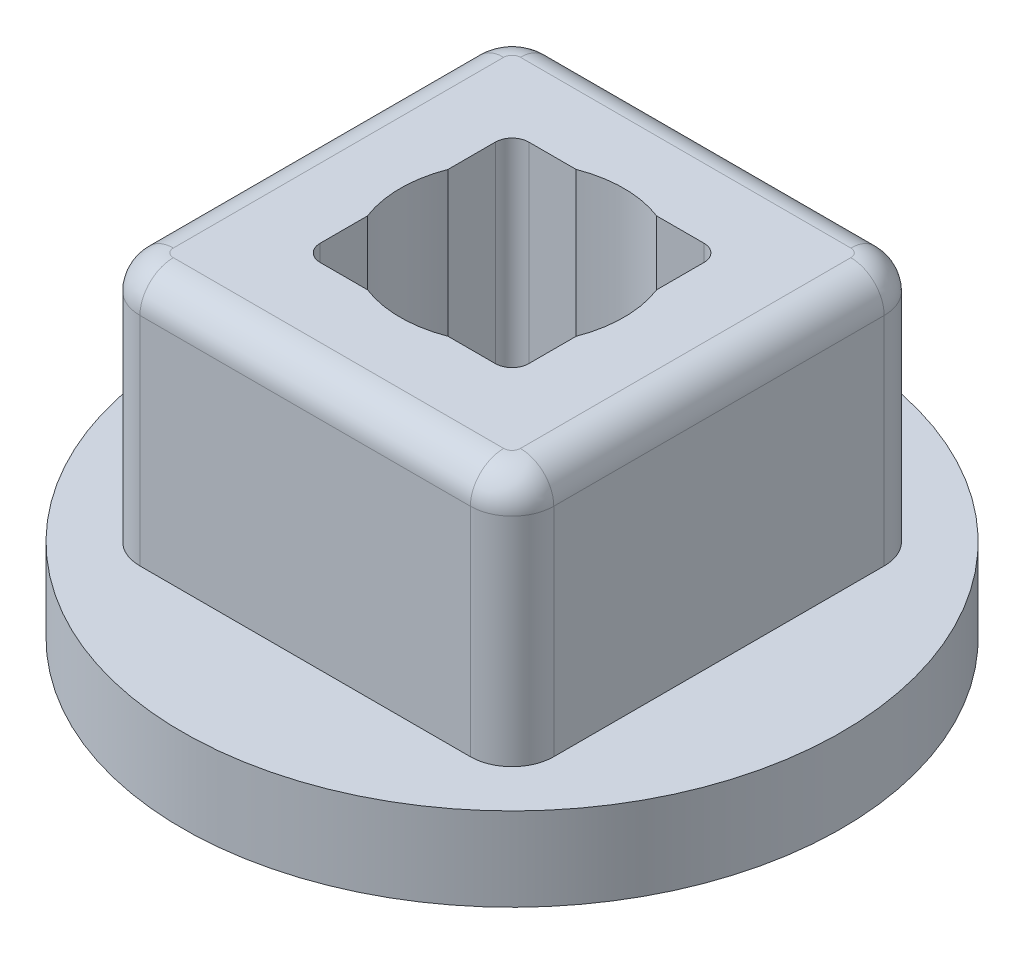
ISO-10303-21;
HEADER;
FILE_DESCRIPTION(('STEP AP214'),'2;1');
FILE_NAME('part.step','',(''),(''),'','','');
FILE_SCHEMA(('AUTOMOTIVE_DESIGN { 1 0 10303 214 1 1 1 1 }'));
ENDSEC;
DATA;
#1=APPLICATION_CONTEXT('core data for automotive mechanical design processes');
#2=APPLICATION_PROTOCOL_DEFINITION('international standard','automotive_design',2000,#1);
#3=PRODUCT_CONTEXT('',#1,'mechanical');
#4=PRODUCT('Part','Part','',(#3));
#5=PRODUCT_RELATED_PRODUCT_CATEGORY('part','',(#4));
#6=PRODUCT_DEFINITION_FORMATION('','',#4);
#7=PRODUCT_DEFINITION_CONTEXT('part definition',#1,'design');
#8=PRODUCT_DEFINITION('design','',#6,#7);
#9=PRODUCT_DEFINITION_SHAPE('','',#8);
#10=(LENGTH_UNIT() NAMED_UNIT(*) SI_UNIT(.MILLI.,.METRE.));
#11=(NAMED_UNIT(*) PLANE_ANGLE_UNIT() SI_UNIT($,.RADIAN.));
#12=(NAMED_UNIT(*) SI_UNIT($,.STERADIAN.) SOLID_ANGLE_UNIT());
#13=UNCERTAINTY_MEASURE_WITH_UNIT(LENGTH_MEASURE(1.E-05),#10,'distance_accuracy_value','');
#14=(GEOMETRIC_REPRESENTATION_CONTEXT(3) GLOBAL_UNCERTAINTY_ASSIGNED_CONTEXT((#13)) GLOBAL_UNIT_ASSIGNED_CONTEXT((#10,
#11,#12)) REPRESENTATION_CONTEXT('',''));
#15=CARTESIAN_POINT('',(0.,0.,0.));
#16=DIRECTION('',(0.,0.,1.));
#17=DIRECTION('',(1.,0.,0.));
#18=AXIS2_PLACEMENT_3D('',#15,#16,#17);
#19=CARTESIAN_POINT('',(-1.5875,5.08,1.5875));
#20=DIRECTION('',(-1.,0.,0.));
#21=DIRECTION('',(0.,0.,1.));
#22=AXIS2_PLACEMENT_3D('',#19,#20,#21);
#23=PLANE('',#22);
#24=DIRECTION('',(0.,0.,-1.));
#25=VECTOR('',#24,1.);
#26=CARTESIAN_POINT('',(-1.5875,0.,1.5875));
#27=LINE('',#26,#25);
#28=CARTESIAN_POINT('',(-1.5875,0.,1.3335));
#29=VERTEX_POINT('',#28);
#30=CARTESIAN_POINT('',(-1.5875,0.,0.613161471392323));
#31=VERTEX_POINT('',#30);
#32=EDGE_CURVE('E253',#29,#31,#27,.T.);
#33=ORIENTED_EDGE('',*,*,#32,.T.);
#34=DIRECTION('',(0.,1.,0.));
#35=VECTOR('',#34,1.);
#36=CARTESIAN_POINT('',(-1.5875,-45.974,0.613161471392323));
#37=LINE('',#36,#35);
#38=CARTESIAN_POINT('',(-1.5875,5.08,0.613161471392323));
#39=VERTEX_POINT('',#38);
#40=EDGE_CURVE('E389',#31,#39,#37,.T.);
#41=ORIENTED_EDGE('',*,*,#40,.T.);
#42=DIRECTION('',(0.,0.,-1.));
#43=VECTOR('',#42,1.);
#44=CARTESIAN_POINT('',(-1.5875,5.08,1.5875));
#45=LINE('',#44,#43);
#46=CARTESIAN_POINT('',(-1.5875,5.08,1.3335));
#47=VERTEX_POINT('',#46);
#48=EDGE_CURVE('E440',#47,#39,#45,.T.);
#49=ORIENTED_EDGE('',*,*,#48,.F.);
#50=DIRECTION('',(0.,-1.,0.));
#51=VECTOR('',#50,1.);
#52=CARTESIAN_POINT('',(-1.5875,0.,1.3335));
#53=LINE('',#52,#51);
#54=EDGE_CURVE('E313',#47,#29,#53,.T.);
#55=ORIENTED_EDGE('',*,*,#54,.T.);
#56=EDGE_LOOP('',(#33,#41,#49,#55));
#57=FACE_BOUND('',#56,.T.);
#58=ADVANCED_FACE('F34',(#57),#23,.F.);
#59=CARTESIAN_POINT('',(1.5875,5.08,1.5875));
#60=DIRECTION('',(0.,0.,1.));
#61=DIRECTION('',(1.,0.,0.));
#62=AXIS2_PLACEMENT_3D('',#59,#60,#61);
#63=PLANE('',#62);
#64=DIRECTION('',(-1.,0.,0.));
#65=VECTOR('',#64,1.);
#66=CARTESIAN_POINT('',(1.5875,0.,1.5875));
#67=LINE('',#66,#65);
#68=CARTESIAN_POINT('',(1.3335,0.,1.5875));
#69=VERTEX_POINT('',#68);
#70=CARTESIAN_POINT('',(0.613161471392323,0.,1.5875));
#71=VERTEX_POINT('',#70);
#72=EDGE_CURVE('E236',#69,#71,#67,.T.);
#73=ORIENTED_EDGE('',*,*,#72,.T.);
#74=DIRECTION('',(0.,1.,0.));
#75=VECTOR('',#74,1.);
#76=CARTESIAN_POINT('',(0.613161471392323,-45.974,1.5875));
#77=LINE('',#76,#75);
#78=CARTESIAN_POINT('',(0.613161471392323,5.08,1.5875));
#79=VERTEX_POINT('',#78);
#80=EDGE_CURVE('E220',#71,#79,#77,.T.);
#81=ORIENTED_EDGE('',*,*,#80,.T.);
#82=DIRECTION('',(-1.,0.,0.));
#83=VECTOR('',#82,1.);
#84=CARTESIAN_POINT('',(1.5875,5.08,1.5875));
#85=LINE('',#84,#83);
#86=CARTESIAN_POINT('',(1.3335,5.08,1.5875));
#87=VERTEX_POINT('',#86);
#88=EDGE_CURVE('E233',#87,#79,#85,.T.);
#89=ORIENTED_EDGE('',*,*,#88,.F.);
#90=DIRECTION('',(0.,-1.,0.));
#91=VECTOR('',#90,1.);
#92=CARTESIAN_POINT('',(1.3335,0.,1.5875));
#93=LINE('',#92,#91);
#94=EDGE_CURVE('E316',#87,#69,#93,.T.);
#95=ORIENTED_EDGE('',*,*,#94,.T.);
#96=EDGE_LOOP('',(#73,#81,#89,#95));
#97=FACE_BOUND('',#96,.T.);
#98=ADVANCED_FACE('F231',(#97),#63,.F.);
#99=CARTESIAN_POINT('',(1.5875,5.08,-1.5875));
#100=DIRECTION('',(1.,0.,0.));
#101=DIRECTION('',(0.,0.,-1.));
#102=AXIS2_PLACEMENT_3D('',#99,#100,#101);
#103=PLANE('',#102);
#104=DIRECTION('',(0.,0.,1.));
#105=VECTOR('',#104,1.);
#106=CARTESIAN_POINT('',(1.5875,0.,-1.5875));
#107=LINE('',#106,#105);
#108=CARTESIAN_POINT('',(1.5875,0.,-1.3335));
#109=VERTEX_POINT('',#108);
#110=CARTESIAN_POINT('',(1.5875,0.,-0.613161471392323));
#111=VERTEX_POINT('',#110);
#112=EDGE_CURVE('E262',#109,#111,#107,.T.);
#113=ORIENTED_EDGE('',*,*,#112,.T.);
#114=DIRECTION('',(0.,1.,0.));
#115=VECTOR('',#114,1.);
#116=CARTESIAN_POINT('',(1.5875,-45.974,-0.613161471392323));
#117=LINE('',#116,#115);
#118=CARTESIAN_POINT('',(1.5875,5.08,-0.613161471392323));
#119=VERTEX_POINT('',#118);
#120=EDGE_CURVE('E434',#111,#119,#117,.T.);
#121=ORIENTED_EDGE('',*,*,#120,.T.);
#122=DIRECTION('',(0.,0.,1.));
#123=VECTOR('',#122,1.);
#124=CARTESIAN_POINT('',(1.5875,5.08,-1.5875));
#125=LINE('',#124,#123);
#126=CARTESIAN_POINT('',(1.5875,5.08,-1.3335));
#127=VERTEX_POINT('',#126);
#128=EDGE_CURVE('E249',#127,#119,#125,.T.);
#129=ORIENTED_EDGE('',*,*,#128,.F.);
#130=DIRECTION('',(0.,-1.,0.));
#131=VECTOR('',#130,1.);
#132=CARTESIAN_POINT('',(1.5875,0.,-1.3335));
#133=LINE('',#132,#131);
#134=EDGE_CURVE('E330',#127,#109,#133,.T.);
#135=ORIENTED_EDGE('',*,*,#134,.T.);
#136=EDGE_LOOP('',(#113,#121,#129,#135));
#137=FACE_BOUND('',#136,.T.);
#138=ADVANCED_FACE('F433',(#137),#103,.F.);
#139=CARTESIAN_POINT('',(-1.5875,5.08,-1.5875));
#140=DIRECTION('',(0.,0.,-1.));
#141=DIRECTION('',(-1.,0.,0.));
#142=AXIS2_PLACEMENT_3D('',#139,#140,#141);
#143=PLANE('',#142);
#144=DIRECTION('',(1.,0.,0.));
#145=VECTOR('',#144,1.);
#146=CARTESIAN_POINT('',(-1.5875,0.,-1.5875));
#147=LINE('',#146,#145);
#148=CARTESIAN_POINT('',(-1.3335,0.,-1.5875));
#149=VERTEX_POINT('',#148);
#150=CARTESIAN_POINT('',(-0.613161471392323,0.,-1.5875));
#151=VERTEX_POINT('',#150);
#152=EDGE_CURVE('E258',#149,#151,#147,.T.);
#153=ORIENTED_EDGE('',*,*,#152,.T.);
#154=DIRECTION('',(0.,1.,0.));
#155=VECTOR('',#154,1.);
#156=CARTESIAN_POINT('',(-0.613161471392323,-45.974,-1.5875));
#157=LINE('',#156,#155);
#158=CARTESIAN_POINT('',(-0.613161471392323,5.08,-1.5875));
#159=VERTEX_POINT('',#158);
#160=EDGE_CURVE('E11',#151,#159,#157,.T.);
#161=ORIENTED_EDGE('',*,*,#160,.T.);
#162=DIRECTION('',(1.,0.,0.));
#163=VECTOR('',#162,1.);
#164=CARTESIAN_POINT('',(-1.5875,5.08,-1.5875));
#165=LINE('',#164,#163);
#166=CARTESIAN_POINT('',(-1.3335,5.08,-1.5875));
#167=VERTEX_POINT('',#166);
#168=EDGE_CURVE('E436',#167,#159,#165,.T.);
#169=ORIENTED_EDGE('',*,*,#168,.F.);
#170=DIRECTION('',(0.,-1.,0.));
#171=VECTOR('',#170,1.);
#172=CARTESIAN_POINT('',(-1.3335,0.,-1.5875));
#173=LINE('',#172,#171);
#174=EDGE_CURVE('E324',#167,#149,#173,.T.);
#175=ORIENTED_EDGE('',*,*,#174,.T.);
#176=EDGE_LOOP('',(#153,#161,#169,#175));
#177=FACE_BOUND('',#176,.T.);
#178=ADVANCED_FACE('F501',(#177),#143,.F.);
#179=CARTESIAN_POINT('',(5.0165,1.27,0.));
#180=DIRECTION('',(0.,1.,0.));
#181=DIRECTION('',(0.,0.,1.));
#182=AXIS2_PLACEMENT_3D('',#179,#180,#181);
#183=PLANE('',#182);
#184=CARTESIAN_POINT('',(0.,1.27,0.));
#185=DIRECTION('',(0.,-1.,0.));
#186=DIRECTION('',(0.,0.,-1.));
#187=AXIS2_PLACEMENT_3D('',#184,#185,#186);
#188=CIRCLE('',#187,5.0165);
#189=CARTESIAN_POINT('',(0.,1.27,-5.0165));
#190=VERTEX_POINT('',#189);
#191=EDGE_CURVE('E279',#190,#190,#188,.T.);
#192=ORIENTED_EDGE('',*,*,#191,.F.);
#193=EDGE_LOOP('',(#192));
#194=FACE_BOUND('',#193,.T.);
#195=DIRECTION('',(-1.,0.,0.));
#196=VECTOR('',#195,1.);
#197=CARTESIAN_POINT('',(-3.1496,1.27,-3.1496));
#198=LINE('',#197,#196);
#199=CARTESIAN_POINT('',(2.5146,1.27,-3.1496));
#200=VERTEX_POINT('',#199);
#201=CARTESIAN_POINT('',(-2.5146,1.27,-3.1496));
#202=VERTEX_POINT('',#201);
#203=EDGE_CURVE('E247',#200,#202,#198,.T.);
#204=ORIENTED_EDGE('',*,*,#203,.F.);
#205=CARTESIAN_POINT('',(2.5146,1.27,-2.5146));
#206=DIRECTION('',(0.,1.,0.));
#207=DIRECTION('',(0.,0.,1.));
#208=AXIS2_PLACEMENT_3D('',#205,#206,#207);
#209=CIRCLE('',#208,0.635);
#210=CARTESIAN_POINT('',(3.1496,1.27,-2.5146));
#211=VERTEX_POINT('',#210);
#212=EDGE_CURVE('E308',#200,#211,#209,.F.);
#213=ORIENTED_EDGE('',*,*,#212,.T.);
#214=DIRECTION('',(0.,0.,-1.));
#215=VECTOR('',#214,1.);
#216=CARTESIAN_POINT('',(3.1496,1.27,-3.1496));
#217=LINE('',#216,#215);
#218=CARTESIAN_POINT('',(3.1496,1.27,2.5146));
#219=VERTEX_POINT('',#218);
#220=EDGE_CURVE('E243',#219,#211,#217,.T.);
#221=ORIENTED_EDGE('',*,*,#220,.F.);
#222=CARTESIAN_POINT('',(2.5146,1.27,2.5146));
#223=DIRECTION('',(0.,1.,0.));
#224=DIRECTION('',(0.,0.,1.));
#225=AXIS2_PLACEMENT_3D('',#222,#223,#224);
#226=CIRCLE('',#225,0.635);
#227=CARTESIAN_POINT('',(2.5146,1.27,3.1496));
#228=VERTEX_POINT('',#227);
#229=EDGE_CURVE('E304',#219,#228,#226,.F.);
#230=ORIENTED_EDGE('',*,*,#229,.T.);
#231=DIRECTION('',(1.,0.,0.));
#232=VECTOR('',#231,1.);
#233=CARTESIAN_POINT('',(3.1496,1.27,3.1496));
#234=LINE('',#233,#232);
#235=CARTESIAN_POINT('',(-2.5146,1.27,3.1496));
#236=VERTEX_POINT('',#235);
#237=EDGE_CURVE('E273',#236,#228,#234,.T.);
#238=ORIENTED_EDGE('',*,*,#237,.F.);
#239=CARTESIAN_POINT('',(-2.5146,1.27,2.5146));
#240=DIRECTION('',(0.,1.,0.));
#241=DIRECTION('',(0.,0.,1.));
#242=AXIS2_PLACEMENT_3D('',#239,#240,#241);
#243=CIRCLE('',#242,0.635);
#244=CARTESIAN_POINT('',(-3.1496,1.27,2.5146));
#245=VERTEX_POINT('',#244);
#246=EDGE_CURVE('E302',#236,#245,#243,.F.);
#247=ORIENTED_EDGE('',*,*,#246,.T.);
#248=DIRECTION('',(0.,0.,1.));
#249=VECTOR('',#248,1.);
#250=CARTESIAN_POINT('',(-3.1496,1.27,3.1496));
#251=LINE('',#250,#249);
#252=CARTESIAN_POINT('',(-3.1496,1.27,-2.5146));
#253=VERTEX_POINT('',#252);
#254=EDGE_CURVE('E270',#253,#245,#251,.T.);
#255=ORIENTED_EDGE('',*,*,#254,.F.);
#256=CARTESIAN_POINT('',(-2.5146,1.27,-2.5146));
#257=DIRECTION('',(0.,1.,0.));
#258=DIRECTION('',(0.,0.,1.));
#259=AXIS2_PLACEMENT_3D('',#256,#257,#258);
#260=CIRCLE('',#259,0.635);
#261=EDGE_CURVE('E306',#253,#202,#260,.F.);
#262=ORIENTED_EDGE('',*,*,#261,.T.);
#263=EDGE_LOOP('',(#204,#213,#221,#230,#238,#247,#255,#262));
#264=FACE_BOUND('',#263,.T.);
#265=ADVANCED_FACE('F532',(#194,#264),#183,.T.);
#266=CARTESIAN_POINT('',(0.,1.27,0.));
#267=DIRECTION('',(0.,-1.,0.));
#268=DIRECTION('',(0.,0.,-1.));
#269=AXIS2_PLACEMENT_3D('',#266,#267,#268);
#270=CYLINDRICAL_SURFACE('',#269,5.0165);
#271=ORIENTED_EDGE('',*,*,#191,.T.);
#272=EDGE_LOOP('',(#271));
#273=FACE_BOUND('',#272,.T.);
#274=CARTESIAN_POINT('',(0.,0.,0.));
#275=DIRECTION('',(0.,-1.,0.));
#276=DIRECTION('',(0.,0.,-1.));
#277=AXIS2_PLACEMENT_3D('',#274,#275,#276);
#278=CIRCLE('',#277,5.0165);
#279=CARTESIAN_POINT('',(0.,0.,-5.0165));
#280=VERTEX_POINT('',#279);
#281=EDGE_CURVE('E276',#280,#280,#278,.T.);
#282=ORIENTED_EDGE('',*,*,#281,.F.);
#283=EDGE_LOOP('',(#282));
#284=FACE_BOUND('',#283,.T.);
#285=ADVANCED_FACE('F529',(#273,#284),#270,.T.);
#286=CARTESIAN_POINT('',(0.,0.,0.));
#287=DIRECTION('',(0.,-1.,0.));
#288=DIRECTION('',(0.,0.,-1.));
#289=AXIS2_PLACEMENT_3D('',#286,#287,#288);
#290=PLANE('',#289);
#291=CARTESIAN_POINT('',(0.,0.,0.));
#292=DIRECTION('',(0.,-1.,0.));
#293=DIRECTION('',(0.,0.,-1.));
#294=AXIS2_PLACEMENT_3D('',#291,#292,#293);
#295=CIRCLE('',#294,1.7018);
#296=CARTESIAN_POINT('',(1.5875,0.,0.613161471392323));
#297=VERTEX_POINT('',#296);
#298=EDGE_CURVE('E449',#111,#297,#295,.T.);
#299=ORIENTED_EDGE('',*,*,#298,.F.);
#300=ORIENTED_EDGE('',*,*,#112,.F.);
#301=CARTESIAN_POINT('',(1.3335,0.,-1.3335));
#302=DIRECTION('',(0.,-1.,0.));
#303=DIRECTION('',(0.,0.,-1.));
#304=AXIS2_PLACEMENT_3D('',#301,#302,#303);
#305=CIRCLE('',#304,0.254);
#306=CARTESIAN_POINT('',(1.3335,0.,-1.5875));
#307=VERTEX_POINT('',#306);
#308=EDGE_CURVE('E343',#109,#307,#305,.F.);
#309=ORIENTED_EDGE('',*,*,#308,.T.);
#310=CARTESIAN_POINT('',(0.613161471392323,0.,-1.5875));
#311=VERTEX_POINT('',#310);
#312=EDGE_CURVE('E256',#311,#307,#147,.T.);
#313=ORIENTED_EDGE('',*,*,#312,.F.);
#314=EDGE_CURVE('E422',#151,#311,#295,.T.);
#315=ORIENTED_EDGE('',*,*,#314,.F.);
#316=ORIENTED_EDGE('',*,*,#152,.F.);
#317=CARTESIAN_POINT('',(-1.3335,0.,-1.3335));
#318=DIRECTION('',(0.,-1.,0.));
#319=DIRECTION('',(0.,0.,-1.));
#320=AXIS2_PLACEMENT_3D('',#317,#318,#319);
#321=CIRCLE('',#320,0.254);
#322=CARTESIAN_POINT('',(-1.5875,0.,-1.3335));
#323=VERTEX_POINT('',#322);
#324=EDGE_CURVE('E338',#149,#323,#321,.F.);
#325=ORIENTED_EDGE('',*,*,#324,.T.);
#326=CARTESIAN_POINT('',(-1.5875,0.,-0.613161471392323));
#327=VERTEX_POINT('',#326);
#328=EDGE_CURVE('E257',#327,#323,#27,.T.);
#329=ORIENTED_EDGE('',*,*,#328,.F.);
#330=EDGE_CURVE('E49',#31,#327,#295,.T.);
#331=ORIENTED_EDGE('',*,*,#330,.F.);
#332=ORIENTED_EDGE('',*,*,#32,.F.);
#333=CARTESIAN_POINT('',(-1.3335,0.,1.3335));
#334=DIRECTION('',(0.,-1.,0.));
#335=DIRECTION('',(0.,0.,-1.));
#336=AXIS2_PLACEMENT_3D('',#333,#334,#335);
#337=CIRCLE('',#336,0.254);
#338=CARTESIAN_POINT('',(-1.3335,0.,1.5875));
#339=VERTEX_POINT('',#338);
#340=EDGE_CURVE('E333',#29,#339,#337,.F.);
#341=ORIENTED_EDGE('',*,*,#340,.T.);
#342=CARTESIAN_POINT('',(-0.613161471392323,0.,1.5875));
#343=VERTEX_POINT('',#342);
#344=EDGE_CURVE('E265',#343,#339,#67,.T.);
#345=ORIENTED_EDGE('',*,*,#344,.F.);
#346=EDGE_CURVE('E57',#71,#343,#295,.T.);
#347=ORIENTED_EDGE('',*,*,#346,.F.);
#348=ORIENTED_EDGE('',*,*,#72,.F.);
#349=CARTESIAN_POINT('',(1.3335,0.,1.3335));
#350=DIRECTION('',(0.,-1.,0.));
#351=DIRECTION('',(0.,0.,-1.));
#352=AXIS2_PLACEMENT_3D('',#349,#350,#351);
#353=CIRCLE('',#352,0.254);
#354=CARTESIAN_POINT('',(1.5875,0.,1.3335));
#355=VERTEX_POINT('',#354);
#356=EDGE_CURVE('E348',#69,#355,#353,.F.);
#357=ORIENTED_EDGE('',*,*,#356,.T.);
#358=EDGE_CURVE('E261',#297,#355,#107,.T.);
#359=ORIENTED_EDGE('',*,*,#358,.F.);
#360=EDGE_LOOP('',(#299,#300,#309,#313,#315,#316,#325,#329,#331,#332,#341,#345,#347,#348,#357,#359));
#361=FACE_BOUND('',#360,.T.);
#362=ORIENTED_EDGE('',*,*,#281,.T.);
#363=EDGE_LOOP('',(#362));
#364=FACE_BOUND('',#363,.T.);
#365=ADVANCED_FACE('F419',(#361,#364),#290,.T.);
#366=CARTESIAN_POINT('',(3.1496,5.08,-3.1496));
#367=DIRECTION('',(-1.,0.,0.));
#368=DIRECTION('',(0.,0.,1.));
#369=AXIS2_PLACEMENT_3D('',#366,#367,#368);
#370=PLANE('',#369);
#371=DIRECTION('',(0.,-1.,0.));
#372=VECTOR('',#371,1.);
#373=CARTESIAN_POINT('',(3.1496,5.08,-2.5146));
#374=LINE('',#373,#372);
#375=CARTESIAN_POINT('',(3.1496,4.572,-2.5146));
#376=VERTEX_POINT('',#375);
#377=EDGE_CURVE('E292',#211,#376,#374,.F.);
#378=ORIENTED_EDGE('',*,*,#377,.T.);
#379=DIRECTION('',(0.,0.,-1.));
#380=VECTOR('',#379,1.);
#381=CARTESIAN_POINT('',(3.1496,4.572,-3.1496));
#382=LINE('',#381,#380);
#383=CARTESIAN_POINT('',(3.1496,4.572,2.5146));
#384=VERTEX_POINT('',#383);
#385=EDGE_CURVE('E384',#376,#384,#382,.F.);
#386=ORIENTED_EDGE('',*,*,#385,.T.);
#387=DIRECTION('',(0.,-1.,0.));
#388=VECTOR('',#387,1.);
#389=CARTESIAN_POINT('',(3.1496,5.08,2.5146));
#390=LINE('',#389,#388);
#391=EDGE_CURVE('E295',#384,#219,#390,.T.);
#392=ORIENTED_EDGE('',*,*,#391,.T.);
#393=ORIENTED_EDGE('',*,*,#220,.T.);
#394=EDGE_LOOP('',(#378,#386,#392,#393));
#395=FACE_BOUND('',#394,.T.);
#396=ADVANCED_FACE('F539',(#395),#370,.F.);
#397=CARTESIAN_POINT('',(-3.1496,5.08,-3.1496));
#398=DIRECTION('',(0.,0.,1.));
#399=DIRECTION('',(1.,0.,0.));
#400=AXIS2_PLACEMENT_3D('',#397,#398,#399);
#401=PLANE('',#400);
#402=DIRECTION('',(0.,-1.,0.));
#403=VECTOR('',#402,1.);
#404=CARTESIAN_POINT('',(-2.5146,5.08,-3.1496));
#405=LINE('',#404,#403);
#406=CARTESIAN_POINT('',(-2.5146,4.572,-3.1496));
#407=VERTEX_POINT('',#406);
#408=EDGE_CURVE('E299',#202,#407,#405,.F.);
#409=ORIENTED_EDGE('',*,*,#408,.T.);
#410=DIRECTION('',(-1.,0.,0.));
#411=VECTOR('',#410,1.);
#412=CARTESIAN_POINT('',(-3.1496,4.572,-3.1496));
#413=LINE('',#412,#411);
#414=CARTESIAN_POINT('',(2.5146,4.572,-3.1496));
#415=VERTEX_POINT('',#414);
#416=EDGE_CURVE('E378',#407,#415,#413,.F.);
#417=ORIENTED_EDGE('',*,*,#416,.T.);
#418=DIRECTION('',(0.,-1.,0.));
#419=VECTOR('',#418,1.);
#420=CARTESIAN_POINT('',(2.5146,5.08,-3.1496));
#421=LINE('',#420,#419);
#422=EDGE_CURVE('E297',#415,#200,#421,.T.);
#423=ORIENTED_EDGE('',*,*,#422,.T.);
#424=ORIENTED_EDGE('',*,*,#203,.T.);
#425=EDGE_LOOP('',(#409,#417,#423,#424));
#426=FACE_BOUND('',#425,.T.);
#427=ADVANCED_FACE('F542',(#426),#401,.F.);
#428=CARTESIAN_POINT('',(-3.1496,5.08,3.1496));
#429=DIRECTION('',(1.,0.,0.));
#430=DIRECTION('',(0.,0.,-1.));
#431=AXIS2_PLACEMENT_3D('',#428,#429,#430);
#432=PLANE('',#431);
#433=DIRECTION('',(0.,-1.,0.));
#434=VECTOR('',#433,1.);
#435=CARTESIAN_POINT('',(-3.1496,5.08,2.5146));
#436=LINE('',#435,#434);
#437=CARTESIAN_POINT('',(-3.1496,4.572,2.5146));
#438=VERTEX_POINT('',#437);
#439=EDGE_CURVE('E289',#245,#438,#436,.F.);
#440=ORIENTED_EDGE('',*,*,#439,.T.);
#441=DIRECTION('',(0.,0.,1.));
#442=VECTOR('',#441,1.);
#443=CARTESIAN_POINT('',(-3.1496,4.572,3.1496));
#444=LINE('',#443,#442);
#445=CARTESIAN_POINT('',(-3.1496,4.572,-2.5146));
#446=VERTEX_POINT('',#445);
#447=EDGE_CURVE('E369',#438,#446,#444,.F.);
#448=ORIENTED_EDGE('',*,*,#447,.T.);
#449=DIRECTION('',(0.,-1.,0.));
#450=VECTOR('',#449,1.);
#451=CARTESIAN_POINT('',(-3.1496,5.08,-2.5146));
#452=LINE('',#451,#450);
#453=EDGE_CURVE('E287',#446,#253,#452,.T.);
#454=ORIENTED_EDGE('',*,*,#453,.T.);
#455=ORIENTED_EDGE('',*,*,#254,.T.);
#456=EDGE_LOOP('',(#440,#448,#454,#455));
#457=FACE_BOUND('',#456,.T.);
#458=ADVANCED_FACE('F546',(#457),#432,.F.);
#459=CARTESIAN_POINT('',(3.1496,5.08,3.1496));
#460=DIRECTION('',(0.,0.,-1.));
#461=DIRECTION('',(-1.,0.,0.));
#462=AXIS2_PLACEMENT_3D('',#459,#460,#461);
#463=PLANE('',#462);
#464=DIRECTION('',(0.,-1.,0.));
#465=VECTOR('',#464,1.);
#466=CARTESIAN_POINT('',(2.5146,5.08,3.1496));
#467=LINE('',#466,#465);
#468=CARTESIAN_POINT('',(2.5146,4.572,3.1496));
#469=VERTEX_POINT('',#468);
#470=EDGE_CURVE('E282',#228,#469,#467,.F.);
#471=ORIENTED_EDGE('',*,*,#470,.T.);
#472=DIRECTION('',(1.,0.,0.));
#473=VECTOR('',#472,1.);
#474=CARTESIAN_POINT('',(3.1496,4.572,3.1496));
#475=LINE('',#474,#473);
#476=CARTESIAN_POINT('',(-2.5146,4.572,3.1496));
#477=VERTEX_POINT('',#476);
#478=EDGE_CURVE('E376',#469,#477,#475,.F.);
#479=ORIENTED_EDGE('',*,*,#478,.T.);
#480=DIRECTION('',(0.,-1.,0.));
#481=VECTOR('',#480,1.);
#482=CARTESIAN_POINT('',(-2.5146,5.08,3.1496));
#483=LINE('',#482,#481);
#484=EDGE_CURVE('E285',#477,#236,#483,.T.);
#485=ORIENTED_EDGE('',*,*,#484,.T.);
#486=ORIENTED_EDGE('',*,*,#237,.T.);
#487=EDGE_LOOP('',(#471,#479,#485,#486));
#488=FACE_BOUND('',#487,.T.);
#489=ADVANCED_FACE('F491',(#488),#463,.F.);
#490=CARTESIAN_POINT('',(0.,5.08,0.));
#491=DIRECTION('',(0.,-1.,0.));
#492=DIRECTION('',(0.,0.,-1.));
#493=AXIS2_PLACEMENT_3D('',#490,#491,#492);
#494=PLANE('',#493);
#495=CARTESIAN_POINT('',(-2.5146,5.08,-2.5146));
#496=DIRECTION('',(0.,-1.,0.));
#497=DIRECTION('',(0.,0.,-1.));
#498=AXIS2_PLACEMENT_3D('',#495,#496,#497);
#499=CIRCLE('',#498,0.127);
#500=CARTESIAN_POINT('',(-2.5146,5.08,-2.6416));
#501=VERTEX_POINT('',#500);
#502=CARTESIAN_POINT('',(-2.6416,5.08,-2.5146));
#503=VERTEX_POINT('',#502);
#504=EDGE_CURVE('E362',#501,#503,#499,.F.);
#505=ORIENTED_EDGE('',*,*,#504,.T.);
#506=DIRECTION('',(0.,0.,1.));
#507=VECTOR('',#506,1.);
#508=CARTESIAN_POINT('',(-2.6416,5.08,0.));
#509=LINE('',#508,#507);
#510=CARTESIAN_POINT('',(-2.6416,5.08,2.5146));
#511=VERTEX_POINT('',#510);
#512=EDGE_CURVE('E366',#503,#511,#509,.T.);
#513=ORIENTED_EDGE('',*,*,#512,.T.);
#514=CARTESIAN_POINT('',(-2.5146,5.08,2.5146));
#515=DIRECTION('',(0.,-1.,0.));
#516=DIRECTION('',(0.,0.,-1.));
#517=AXIS2_PLACEMENT_3D('',#514,#515,#516);
#518=CIRCLE('',#517,0.127);
#519=CARTESIAN_POINT('',(-2.5146,5.08,2.6416));
#520=VERTEX_POINT('',#519);
#521=EDGE_CURVE('E364',#511,#520,#518,.F.);
#522=ORIENTED_EDGE('',*,*,#521,.T.);
#523=DIRECTION('',(1.,0.,0.));
#524=VECTOR('',#523,1.);
#525=CARTESIAN_POINT('',(0.,5.08,2.6416));
#526=LINE('',#525,#524);
#527=CARTESIAN_POINT('',(2.5146,5.08,2.6416));
#528=VERTEX_POINT('',#527);
#529=EDGE_CURVE('E360',#520,#528,#526,.T.);
#530=ORIENTED_EDGE('',*,*,#529,.T.);
#531=CARTESIAN_POINT('',(2.5146,5.08,2.5146));
#532=DIRECTION('',(0.,-1.,0.));
#533=DIRECTION('',(0.,0.,-1.));
#534=AXIS2_PLACEMENT_3D('',#531,#532,#533);
#535=CIRCLE('',#534,0.127);
#536=CARTESIAN_POINT('',(2.6416,5.08,2.5146));
#537=VERTEX_POINT('',#536);
#538=EDGE_CURVE('E356',#528,#537,#535,.F.);
#539=ORIENTED_EDGE('',*,*,#538,.T.);
#540=DIRECTION('',(0.,0.,-1.));
#541=VECTOR('',#540,1.);
#542=CARTESIAN_POINT('',(2.6416,5.08,0.));
#543=LINE('',#542,#541);
#544=CARTESIAN_POINT('',(2.6416,5.08,-2.5146));
#545=VERTEX_POINT('',#544);
#546=EDGE_CURVE('E352',#537,#545,#543,.T.);
#547=ORIENTED_EDGE('',*,*,#546,.T.);
#548=CARTESIAN_POINT('',(2.5146,5.08,-2.5146));
#549=DIRECTION('',(0.,-1.,0.));
#550=DIRECTION('',(0.,0.,-1.));
#551=AXIS2_PLACEMENT_3D('',#548,#549,#550);
#552=CIRCLE('',#551,0.127);
#553=CARTESIAN_POINT('',(2.5146,5.08,-2.6416));
#554=VERTEX_POINT('',#553);
#555=EDGE_CURVE('E354',#545,#554,#552,.F.);
#556=ORIENTED_EDGE('',*,*,#555,.T.);
#557=DIRECTION('',(-1.,0.,0.));
#558=VECTOR('',#557,1.);
#559=CARTESIAN_POINT('',(0.,5.08,-2.6416));
#560=LINE('',#559,#558);
#561=EDGE_CURVE('E358',#554,#501,#560,.T.);
#562=ORIENTED_EDGE('',*,*,#561,.T.);
#563=EDGE_LOOP('',(#505,#513,#522,#530,#539,#547,#556,#562));
#564=FACE_BOUND('',#563,.T.);
#565=ORIENTED_EDGE('',*,*,#128,.T.);
#566=CARTESIAN_POINT('',(0.,5.08,0.));
#567=DIRECTION('',(0.,1.,0.));
#568=DIRECTION('',(0.,0.,1.));
#569=AXIS2_PLACEMENT_3D('',#566,#567,#568);
#570=CIRCLE('',#569,1.7018);
#571=CARTESIAN_POINT('',(1.5875,5.08,0.613161471392323));
#572=VERTEX_POINT('',#571);
#573=EDGE_CURVE('E227',#572,#119,#570,.T.);
#574=ORIENTED_EDGE('',*,*,#573,.F.);
#575=CARTESIAN_POINT('',(1.5875,5.08,1.3335));
#576=VERTEX_POINT('',#575);
#577=EDGE_CURVE('E435',#572,#576,#125,.T.);
#578=ORIENTED_EDGE('',*,*,#577,.T.);
#579=CARTESIAN_POINT('',(1.3335,5.08,1.3335));
#580=DIRECTION('',(0.,-1.,0.));
#581=DIRECTION('',(0.,0.,-1.));
#582=AXIS2_PLACEMENT_3D('',#579,#580,#581);
#583=CIRCLE('',#582,0.254);
#584=EDGE_CURVE('E242',#576,#87,#583,.T.);
#585=ORIENTED_EDGE('',*,*,#584,.T.);
#586=ORIENTED_EDGE('',*,*,#88,.T.);
#587=CARTESIAN_POINT('',(-0.613161471392323,5.08,1.5875));
#588=VERTEX_POINT('',#587);
#589=EDGE_CURVE('E217',#588,#79,#570,.T.);
#590=ORIENTED_EDGE('',*,*,#589,.F.);
#591=CARTESIAN_POINT('',(-1.3335,5.08,1.5875));
#592=VERTEX_POINT('',#591);
#593=EDGE_CURVE('E244',#588,#592,#85,.T.);
#594=ORIENTED_EDGE('',*,*,#593,.T.);
#595=CARTESIAN_POINT('',(-1.3335,5.08,1.3335));
#596=DIRECTION('',(0.,-1.,0.));
#597=DIRECTION('',(0.,0.,-1.));
#598=AXIS2_PLACEMENT_3D('',#595,#596,#597);
#599=CIRCLE('',#598,0.254);
#600=EDGE_CURVE('E336',#592,#47,#599,.T.);
#601=ORIENTED_EDGE('',*,*,#600,.T.);
#602=ORIENTED_EDGE('',*,*,#48,.T.);
#603=CARTESIAN_POINT('',(-1.5875,5.08,-0.613161471392323));
#604=VERTEX_POINT('',#603);
#605=EDGE_CURVE('E225',#604,#39,#570,.T.);
#606=ORIENTED_EDGE('',*,*,#605,.F.);
#607=CARTESIAN_POINT('',(-1.5875,5.08,-1.3335));
#608=VERTEX_POINT('',#607);
#609=EDGE_CURVE('E266',#604,#608,#45,.T.);
#610=ORIENTED_EDGE('',*,*,#609,.T.);
#611=CARTESIAN_POINT('',(-1.3335,5.08,-1.3335));
#612=DIRECTION('',(0.,-1.,0.));
#613=DIRECTION('',(0.,0.,-1.));
#614=AXIS2_PLACEMENT_3D('',#611,#612,#613);
#615=CIRCLE('',#614,0.254);
#616=EDGE_CURVE('E341',#608,#167,#615,.T.);
#617=ORIENTED_EDGE('',*,*,#616,.T.);
#618=ORIENTED_EDGE('',*,*,#168,.T.);
#619=CARTESIAN_POINT('',(0.613161471392323,5.08,-1.5875));
#620=VERTEX_POINT('',#619);
#621=EDGE_CURVE('E453',#620,#159,#570,.T.);
#622=ORIENTED_EDGE('',*,*,#621,.F.);
#623=CARTESIAN_POINT('',(1.3335,5.08,-1.5875));
#624=VERTEX_POINT('',#623);
#625=EDGE_CURVE('E413',#620,#624,#165,.T.);
#626=ORIENTED_EDGE('',*,*,#625,.T.);
#627=CARTESIAN_POINT('',(1.3335,5.08,-1.3335));
#628=DIRECTION('',(0.,-1.,0.));
#629=DIRECTION('',(0.,0.,-1.));
#630=AXIS2_PLACEMENT_3D('',#627,#628,#629);
#631=CIRCLE('',#630,0.254);
#632=EDGE_CURVE('E346',#624,#127,#631,.T.);
#633=ORIENTED_EDGE('',*,*,#632,.T.);
#634=EDGE_LOOP('',(#565,#574,#578,#585,#586,#590,#594,#601,#602,#606,#610,#617,#618,#622,#626,#633));
#635=FACE_BOUND('',#634,.T.);
#636=ADVANCED_FACE('F240',(#564,#635),#494,.F.);
#637=ORIENTED_EDGE('',*,*,#609,.F.);
#638=DIRECTION('',(0.,1.,0.));
#639=VECTOR('',#638,1.);
#640=CARTESIAN_POINT('',(-1.5875,-45.974,-0.613161471392323));
#641=LINE('',#640,#639);
#642=EDGE_CURVE('E237',#604,#327,#641,.F.);
#643=ORIENTED_EDGE('',*,*,#642,.T.);
#644=ORIENTED_EDGE('',*,*,#328,.T.);
#645=DIRECTION('',(0.,-1.,0.));
#646=VECTOR('',#645,1.);
#647=CARTESIAN_POINT('',(-1.5875,5.08,-1.3335));
#648=LINE('',#647,#646);
#649=EDGE_CURVE('E310',#323,#608,#648,.F.);
#650=ORIENTED_EDGE('',*,*,#649,.T.);
#651=EDGE_LOOP('',(#637,#643,#644,#650));
#652=FACE_BOUND('',#651,.T.);
#653=ADVANCED_FACE('F476',(#652),#23,.F.);
#654=ORIENTED_EDGE('',*,*,#593,.F.);
#655=DIRECTION('',(0.,1.,0.));
#656=VECTOR('',#655,1.);
#657=CARTESIAN_POINT('',(-0.613161471392323,-45.974,1.5875));
#658=LINE('',#657,#656);
#659=EDGE_CURVE('E221',#588,#343,#658,.F.);
#660=ORIENTED_EDGE('',*,*,#659,.T.);
#661=ORIENTED_EDGE('',*,*,#344,.T.);
#662=DIRECTION('',(0.,-1.,0.));
#663=VECTOR('',#662,1.);
#664=CARTESIAN_POINT('',(-1.3335,5.08,1.5875));
#665=LINE('',#664,#663);
#666=EDGE_CURVE('E318',#339,#592,#665,.F.);
#667=ORIENTED_EDGE('',*,*,#666,.T.);
#668=EDGE_LOOP('',(#654,#660,#661,#667));
#669=FACE_BOUND('',#668,.T.);
#670=ADVANCED_FACE('F481',(#669),#63,.F.);
#671=ORIENTED_EDGE('',*,*,#577,.F.);
#672=DIRECTION('',(0.,1.,0.));
#673=VECTOR('',#672,1.);
#674=CARTESIAN_POINT('',(1.5875,-45.974,0.613161471392323));
#675=LINE('',#674,#673);
#676=EDGE_CURVE('E450',#572,#297,#675,.F.);
#677=ORIENTED_EDGE('',*,*,#676,.T.);
#678=ORIENTED_EDGE('',*,*,#358,.T.);
#679=DIRECTION('',(0.,-1.,0.));
#680=VECTOR('',#679,1.);
#681=CARTESIAN_POINT('',(1.5875,5.08,1.3335));
#682=LINE('',#681,#680);
#683=EDGE_CURVE('E327',#355,#576,#682,.F.);
#684=ORIENTED_EDGE('',*,*,#683,.T.);
#685=EDGE_LOOP('',(#671,#677,#678,#684));
#686=FACE_BOUND('',#685,.T.);
#687=ADVANCED_FACE('F458',(#686),#103,.F.);
#688=ORIENTED_EDGE('',*,*,#625,.F.);
#689=DIRECTION('',(0.,1.,0.));
#690=VECTOR('',#689,1.);
#691=CARTESIAN_POINT('',(0.613161471392323,-45.974,-1.5875));
#692=LINE('',#691,#690);
#693=EDGE_CURVE('E42',#620,#311,#692,.F.);
#694=ORIENTED_EDGE('',*,*,#693,.T.);
#695=ORIENTED_EDGE('',*,*,#312,.T.);
#696=DIRECTION('',(0.,-1.,0.));
#697=VECTOR('',#696,1.);
#698=CARTESIAN_POINT('',(1.3335,5.08,-1.5875));
#699=LINE('',#698,#697);
#700=EDGE_CURVE('E321',#307,#624,#699,.F.);
#701=ORIENTED_EDGE('',*,*,#700,.T.);
#702=EDGE_LOOP('',(#688,#694,#695,#701));
#703=FACE_BOUND('',#702,.T.);
#704=ADVANCED_FACE('F412',(#703),#143,.F.);
#705=CARTESIAN_POINT('',(-2.5146,5.08,2.5146));
#706=DIRECTION('',(0.,-1.,0.));
#707=DIRECTION('',(0.,0.,-1.));
#708=AXIS2_PLACEMENT_3D('',#705,#706,#707);
#709=CYLINDRICAL_SURFACE('',#708,0.635);
#710=ORIENTED_EDGE('',*,*,#484,.F.);
#711=CARTESIAN_POINT('',(-2.5146,4.572,2.5146));
#712=DIRECTION('',(0.,-1.,0.));
#713=DIRECTION('',(0.,0.,-1.));
#714=AXIS2_PLACEMENT_3D('',#711,#712,#713);
#715=CIRCLE('',#714,0.635);
#716=EDGE_CURVE('E372',#477,#438,#715,.T.);
#717=ORIENTED_EDGE('',*,*,#716,.T.);
#718=ORIENTED_EDGE('',*,*,#439,.F.);
#719=ORIENTED_EDGE('',*,*,#246,.F.);
#720=EDGE_LOOP('',(#710,#717,#718,#719));
#721=FACE_BOUND('',#720,.T.);
#722=ADVANCED_FACE('F524',(#721),#709,.T.);
#723=CARTESIAN_POINT('',(2.5146,5.08,2.5146));
#724=DIRECTION('',(0.,-1.,0.));
#725=DIRECTION('',(0.,0.,-1.));
#726=AXIS2_PLACEMENT_3D('',#723,#724,#725);
#727=CYLINDRICAL_SURFACE('',#726,0.635);
#728=ORIENTED_EDGE('',*,*,#391,.F.);
#729=CARTESIAN_POINT('',(2.5146,4.572,2.5146));
#730=DIRECTION('',(0.,-1.,0.));
#731=DIRECTION('',(0.,0.,-1.));
#732=AXIS2_PLACEMENT_3D('',#729,#730,#731);
#733=CIRCLE('',#732,0.635);
#734=EDGE_CURVE('E380',#384,#469,#733,.T.);
#735=ORIENTED_EDGE('',*,*,#734,.T.);
#736=ORIENTED_EDGE('',*,*,#470,.F.);
#737=ORIENTED_EDGE('',*,*,#229,.F.);
#738=EDGE_LOOP('',(#728,#735,#736,#737));
#739=FACE_BOUND('',#738,.T.);
#740=ADVANCED_FACE('F520',(#739),#727,.T.);
#741=CARTESIAN_POINT('',(-2.5146,5.08,-2.5146));
#742=DIRECTION('',(0.,-1.,0.));
#743=DIRECTION('',(0.,0.,-1.));
#744=AXIS2_PLACEMENT_3D('',#741,#742,#743);
#745=CYLINDRICAL_SURFACE('',#744,0.635);
#746=ORIENTED_EDGE('',*,*,#453,.F.);
#747=CARTESIAN_POINT('',(-2.5146,4.572,-2.5146));
#748=DIRECTION('',(0.,-1.,0.));
#749=DIRECTION('',(0.,0.,-1.));
#750=AXIS2_PLACEMENT_3D('',#747,#748,#749);
#751=CIRCLE('',#750,0.635);
#752=EDGE_CURVE('E374',#446,#407,#751,.T.);
#753=ORIENTED_EDGE('',*,*,#752,.T.);
#754=ORIENTED_EDGE('',*,*,#408,.F.);
#755=ORIENTED_EDGE('',*,*,#261,.F.);
#756=EDGE_LOOP('',(#746,#753,#754,#755));
#757=FACE_BOUND('',#756,.T.);
#758=ADVANCED_FACE('F516',(#757),#745,.T.);
#759=CARTESIAN_POINT('',(2.5146,5.08,-2.5146));
#760=DIRECTION('',(0.,-1.,0.));
#761=DIRECTION('',(0.,0.,-1.));
#762=AXIS2_PLACEMENT_3D('',#759,#760,#761);
#763=CYLINDRICAL_SURFACE('',#762,0.635);
#764=ORIENTED_EDGE('',*,*,#422,.F.);
#765=CARTESIAN_POINT('',(2.5146,4.572,-2.5146));
#766=DIRECTION('',(0.,-1.,0.));
#767=DIRECTION('',(0.,0.,-1.));
#768=AXIS2_PLACEMENT_3D('',#765,#766,#767);
#769=CIRCLE('',#768,0.635);
#770=EDGE_CURVE('E382',#415,#376,#769,.T.);
#771=ORIENTED_EDGE('',*,*,#770,.T.);
#772=ORIENTED_EDGE('',*,*,#377,.F.);
#773=ORIENTED_EDGE('',*,*,#212,.F.);
#774=EDGE_LOOP('',(#764,#771,#772,#773));
#775=FACE_BOUND('',#774,.T.);
#776=ADVANCED_FACE('F510',(#775),#763,.T.);
#777=CARTESIAN_POINT('',(-1.3335,5.08,1.3335));
#778=DIRECTION('',(0.,1.,0.));
#779=DIRECTION('',(0.,0.,1.));
#780=AXIS2_PLACEMENT_3D('',#777,#778,#779);
#781=CYLINDRICAL_SURFACE('',#780,0.254);
#782=ORIENTED_EDGE('',*,*,#600,.F.);
#783=ORIENTED_EDGE('',*,*,#666,.F.);
#784=ORIENTED_EDGE('',*,*,#340,.F.);
#785=ORIENTED_EDGE('',*,*,#54,.F.);
#786=EDGE_LOOP('',(#782,#783,#784,#785));
#787=FACE_BOUND('',#786,.T.);
#788=ADVANCED_FACE('F505',(#787),#781,.F.);
#789=CARTESIAN_POINT('',(-1.3335,5.08,-1.3335));
#790=DIRECTION('',(0.,1.,0.));
#791=DIRECTION('',(0.,0.,1.));
#792=AXIS2_PLACEMENT_3D('',#789,#790,#791);
#793=CYLINDRICAL_SURFACE('',#792,0.254);
#794=ORIENTED_EDGE('',*,*,#616,.F.);
#795=ORIENTED_EDGE('',*,*,#649,.F.);
#796=ORIENTED_EDGE('',*,*,#324,.F.);
#797=ORIENTED_EDGE('',*,*,#174,.F.);
#798=EDGE_LOOP('',(#794,#795,#796,#797));
#799=FACE_BOUND('',#798,.T.);
#800=ADVANCED_FACE('F470',(#799),#793,.F.);
#801=CARTESIAN_POINT('',(1.3335,5.08,-1.3335));
#802=DIRECTION('',(0.,1.,0.));
#803=DIRECTION('',(0.,0.,1.));
#804=AXIS2_PLACEMENT_3D('',#801,#802,#803);
#805=CYLINDRICAL_SURFACE('',#804,0.254);
#806=ORIENTED_EDGE('',*,*,#632,.F.);
#807=ORIENTED_EDGE('',*,*,#700,.F.);
#808=ORIENTED_EDGE('',*,*,#308,.F.);
#809=ORIENTED_EDGE('',*,*,#134,.F.);
#810=EDGE_LOOP('',(#806,#807,#808,#809));
#811=FACE_BOUND('',#810,.T.);
#812=ADVANCED_FACE('F428',(#811),#805,.F.);
#813=CARTESIAN_POINT('',(1.3335,5.08,1.3335));
#814=DIRECTION('',(0.,1.,0.));
#815=DIRECTION('',(0.,0.,1.));
#816=AXIS2_PLACEMENT_3D('',#813,#814,#815);
#817=CYLINDRICAL_SURFACE('',#816,0.254);
#818=ORIENTED_EDGE('',*,*,#584,.F.);
#819=ORIENTED_EDGE('',*,*,#683,.F.);
#820=ORIENTED_EDGE('',*,*,#356,.F.);
#821=ORIENTED_EDGE('',*,*,#94,.F.);
#822=EDGE_LOOP('',(#818,#819,#820,#821));
#823=FACE_BOUND('',#822,.T.);
#824=ADVANCED_FACE('F461',(#823),#817,.F.);
#825=CARTESIAN_POINT('',(2.6416,4.572,0.));
#826=DIRECTION('',(0.,0.,-1.));
#827=DIRECTION('',(-1.,0.,0.));
#828=AXIS2_PLACEMENT_3D('',#825,#826,#827);
#829=CYLINDRICAL_SURFACE('',#828,0.508);
#830=CARTESIAN_POINT('',(2.6416,4.572,2.5146));
#831=DIRECTION('',(0.,0.,1.));
#832=DIRECTION('',(1.,0.,0.));
#833=AXIS2_PLACEMENT_3D('',#830,#831,#832);
#834=CIRCLE('',#833,0.508);
#835=EDGE_CURVE('E403',#384,#537,#834,.T.);
#836=ORIENTED_EDGE('',*,*,#835,.F.);
#837=ORIENTED_EDGE('',*,*,#385,.F.);
#838=CARTESIAN_POINT('',(2.6416,4.572,-2.5146));
#839=DIRECTION('',(0.,0.,-1.));
#840=DIRECTION('',(-1.,0.,0.));
#841=AXIS2_PLACEMENT_3D('',#838,#839,#840);
#842=CIRCLE('',#841,0.508);
#843=EDGE_CURVE('E406',#545,#376,#842,.T.);
#844=ORIENTED_EDGE('',*,*,#843,.F.);
#845=ORIENTED_EDGE('',*,*,#546,.F.);
#846=EDGE_LOOP('',(#836,#837,#844,#845));
#847=FACE_BOUND('',#846,.T.);
#848=ADVANCED_FACE('F36',(#847),#829,.T.);
#849=CARTESIAN_POINT('',(2.5146,4.572,-2.5146));
#850=DIRECTION('',(0.,-1.,0.));
#851=DIRECTION('',(0.,0.,-1.));
#852=AXIS2_PLACEMENT_3D('',#849,#850,#851);
#853=DEGENERATE_TOROIDAL_SURFACE('',#852,0.127,0.508,.T.);
#854=ORIENTED_EDGE('',*,*,#843,.T.);
#855=ORIENTED_EDGE('',*,*,#770,.F.);
#856=CARTESIAN_POINT('',(2.5146,4.572,-2.6416));
#857=DIRECTION('',(-1.,0.,0.));
#858=DIRECTION('',(0.,0.,1.));
#859=AXIS2_PLACEMENT_3D('',#856,#857,#858);
#860=CIRCLE('',#859,0.508);
#861=EDGE_CURVE('E400',#554,#415,#860,.T.);
#862=ORIENTED_EDGE('',*,*,#861,.F.);
#863=ORIENTED_EDGE('',*,*,#555,.F.);
#864=EDGE_LOOP('',(#854,#855,#862,#863));
#865=FACE_BOUND('',#864,.T.);
#866=ADVANCED_FACE('F468',(#865),#853,.T.);
#867=CARTESIAN_POINT('',(2.5146,4.572,2.5146));
#868=DIRECTION('',(0.,-1.,0.));
#869=DIRECTION('',(0.,0.,-1.));
#870=AXIS2_PLACEMENT_3D('',#867,#868,#869);
#871=DEGENERATE_TOROIDAL_SURFACE('',#870,0.127,0.508,.T.);
#872=ORIENTED_EDGE('',*,*,#835,.T.);
#873=ORIENTED_EDGE('',*,*,#538,.F.);
#874=CARTESIAN_POINT('',(2.5146,4.572,2.6416));
#875=DIRECTION('',(-1.,0.,0.));
#876=DIRECTION('',(0.,0.,1.));
#877=AXIS2_PLACEMENT_3D('',#874,#875,#876);
#878=CIRCLE('',#877,0.508);
#879=EDGE_CURVE('E397',#469,#528,#878,.T.);
#880=ORIENTED_EDGE('',*,*,#879,.F.);
#881=ORIENTED_EDGE('',*,*,#734,.F.);
#882=EDGE_LOOP('',(#872,#873,#880,#881));
#883=FACE_BOUND('',#882,.T.);
#884=ADVANCED_FACE('F564',(#883),#871,.T.);
#885=CARTESIAN_POINT('',(0.,4.572,-2.6416));
#886=DIRECTION('',(-1.,0.,0.));
#887=DIRECTION('',(0.,0.,1.));
#888=AXIS2_PLACEMENT_3D('',#885,#886,#887);
#889=CYLINDRICAL_SURFACE('',#888,0.508);
#890=ORIENTED_EDGE('',*,*,#861,.T.);
#891=ORIENTED_EDGE('',*,*,#416,.F.);
#892=CARTESIAN_POINT('',(-2.5146,4.572,-2.6416));
#893=DIRECTION('',(-1.,0.,0.));
#894=DIRECTION('',(0.,0.,1.));
#895=AXIS2_PLACEMENT_3D('',#892,#893,#894);
#896=CIRCLE('',#895,0.508);
#897=EDGE_CURVE('E394',#501,#407,#896,.T.);
#898=ORIENTED_EDGE('',*,*,#897,.F.);
#899=ORIENTED_EDGE('',*,*,#561,.F.);
#900=EDGE_LOOP('',(#890,#891,#898,#899));
#901=FACE_BOUND('',#900,.T.);
#902=ADVANCED_FACE('F594',(#901),#889,.T.);
#903=CARTESIAN_POINT('',(0.,4.572,2.6416));
#904=DIRECTION('',(1.,0.,0.));
#905=DIRECTION('',(0.,0.,-1.));
#906=AXIS2_PLACEMENT_3D('',#903,#904,#905);
#907=CYLINDRICAL_SURFACE('',#906,0.508);
#908=ORIENTED_EDGE('',*,*,#879,.T.);
#909=ORIENTED_EDGE('',*,*,#529,.F.);
#910=CARTESIAN_POINT('',(-2.5146,4.572,2.6416));
#911=DIRECTION('',(-1.,0.,0.));
#912=DIRECTION('',(0.,0.,1.));
#913=AXIS2_PLACEMENT_3D('',#910,#911,#912);
#914=CIRCLE('',#913,0.508);
#915=EDGE_CURVE('E391',#477,#520,#914,.T.);
#916=ORIENTED_EDGE('',*,*,#915,.F.);
#917=ORIENTED_EDGE('',*,*,#478,.F.);
#918=EDGE_LOOP('',(#908,#909,#916,#917));
#919=FACE_BOUND('',#918,.T.);
#920=ADVANCED_FACE('F568',(#919),#907,.T.);
#921=CARTESIAN_POINT('',(-2.5146,4.572,-2.5146));
#922=DIRECTION('',(0.,-1.,0.));
#923=DIRECTION('',(0.,0.,-1.));
#924=AXIS2_PLACEMENT_3D('',#921,#922,#923);
#925=DEGENERATE_TOROIDAL_SURFACE('',#924,0.127,0.508,.T.);
#926=ORIENTED_EDGE('',*,*,#897,.T.);
#927=ORIENTED_EDGE('',*,*,#752,.F.);
#928=CARTESIAN_POINT('',(-2.6416,4.572,-2.5146));
#929=DIRECTION('',(0.,0.,1.));
#930=DIRECTION('',(1.,0.,0.));
#931=AXIS2_PLACEMENT_3D('',#928,#929,#930);
#932=CIRCLE('',#931,0.508);
#933=EDGE_CURVE('E388',#503,#446,#932,.T.);
#934=ORIENTED_EDGE('',*,*,#933,.F.);
#935=ORIENTED_EDGE('',*,*,#504,.F.);
#936=EDGE_LOOP('',(#926,#927,#934,#935));
#937=FACE_BOUND('',#936,.T.);
#938=ADVANCED_FACE('F586',(#937),#925,.T.);
#939=CARTESIAN_POINT('',(-2.5146,4.572,2.5146));
#940=DIRECTION('',(0.,-1.,0.));
#941=DIRECTION('',(0.,0.,-1.));
#942=AXIS2_PLACEMENT_3D('',#939,#940,#941);
#943=DEGENERATE_TOROIDAL_SURFACE('',#942,0.127,0.508,.T.);
#944=ORIENTED_EDGE('',*,*,#915,.T.);
#945=ORIENTED_EDGE('',*,*,#521,.F.);
#946=CARTESIAN_POINT('',(-2.6416,4.572,2.5146));
#947=DIRECTION('',(0.,0.,-1.));
#948=DIRECTION('',(-1.,0.,0.));
#949=AXIS2_PLACEMENT_3D('',#946,#947,#948);
#950=CIRCLE('',#949,0.508);
#951=EDGE_CURVE('E386',#438,#511,#950,.T.);
#952=ORIENTED_EDGE('',*,*,#951,.F.);
#953=ORIENTED_EDGE('',*,*,#716,.F.);
#954=EDGE_LOOP('',(#944,#945,#952,#953));
#955=FACE_BOUND('',#954,.T.);
#956=ADVANCED_FACE('F573',(#955),#943,.T.);
#957=CARTESIAN_POINT('',(-2.6416,4.572,0.));
#958=DIRECTION('',(0.,0.,1.));
#959=DIRECTION('',(1.,0.,0.));
#960=AXIS2_PLACEMENT_3D('',#957,#958,#959);
#961=CYLINDRICAL_SURFACE('',#960,0.508);
#962=ORIENTED_EDGE('',*,*,#933,.T.);
#963=ORIENTED_EDGE('',*,*,#447,.F.);
#964=ORIENTED_EDGE('',*,*,#951,.T.);
#965=ORIENTED_EDGE('',*,*,#512,.F.);
#966=EDGE_LOOP('',(#962,#963,#964,#965));
#967=FACE_BOUND('',#966,.T.);
#968=ADVANCED_FACE('F580',(#967),#961,.T.);
#969=CARTESIAN_POINT('',(0.,-45.974,0.));
#970=DIRECTION('',(0.,1.,0.));
#971=DIRECTION('',(0.,0.,1.));
#972=AXIS2_PLACEMENT_3D('',#969,#970,#971);
#973=CYLINDRICAL_SURFACE('',#972,1.7018);
#974=ORIENTED_EDGE('',*,*,#314,.T.);
#975=ORIENTED_EDGE('',*,*,#693,.F.);
#976=ORIENTED_EDGE('',*,*,#621,.T.);
#977=ORIENTED_EDGE('',*,*,#160,.F.);
#978=EDGE_LOOP('',(#974,#975,#976,#977));
#979=FACE_BOUND('',#978,.T.);
#980=ADVANCED_FACE('F499',(#979),#973,.F.);
#981=ORIENTED_EDGE('',*,*,#298,.T.);
#982=ORIENTED_EDGE('',*,*,#676,.F.);
#983=ORIENTED_EDGE('',*,*,#573,.T.);
#984=ORIENTED_EDGE('',*,*,#120,.F.);
#985=EDGE_LOOP('',(#981,#982,#983,#984));
#986=FACE_BOUND('',#985,.T.);
#987=ADVANCED_FACE('F455',(#986),#973,.F.);
#988=ORIENTED_EDGE('',*,*,#346,.T.);
#989=ORIENTED_EDGE('',*,*,#659,.F.);
#990=ORIENTED_EDGE('',*,*,#589,.T.);
#991=ORIENTED_EDGE('',*,*,#80,.F.);
#992=EDGE_LOOP('',(#988,#989,#990,#991));
#993=FACE_BOUND('',#992,.T.);
#994=ADVANCED_FACE('F219',(#993),#973,.F.);
#995=ORIENTED_EDGE('',*,*,#330,.T.);
#996=ORIENTED_EDGE('',*,*,#642,.F.);
#997=ORIENTED_EDGE('',*,*,#605,.T.);
#998=ORIENTED_EDGE('',*,*,#40,.F.);
#999=EDGE_LOOP('',(#995,#996,#997,#998));
#1000=FACE_BOUND('',#999,.T.);
#1001=ADVANCED_FACE('F627',(#1000),#973,.F.);
#1002=CLOSED_SHELL('',(#58,#98,#138,#178,#265,#285,#365,#396,#427,#458,#489,#636,#653,#670,#687,
#704,#722,#740,#758,#776,#788,#800,#812,#824,#848,#866,#884,#902,#920,#938,#956,#968,#980,#987,
#994,#1001));
#1003=MANIFOLD_SOLID_BREP('B2',#1002);
#1004=ADVANCED_BREP_SHAPE_REPRESENTATION('',(#18,#1003),#14);
#1005=SHAPE_DEFINITION_REPRESENTATION(#9,#1004);
ENDSEC;
END-ISO-10303-21;
